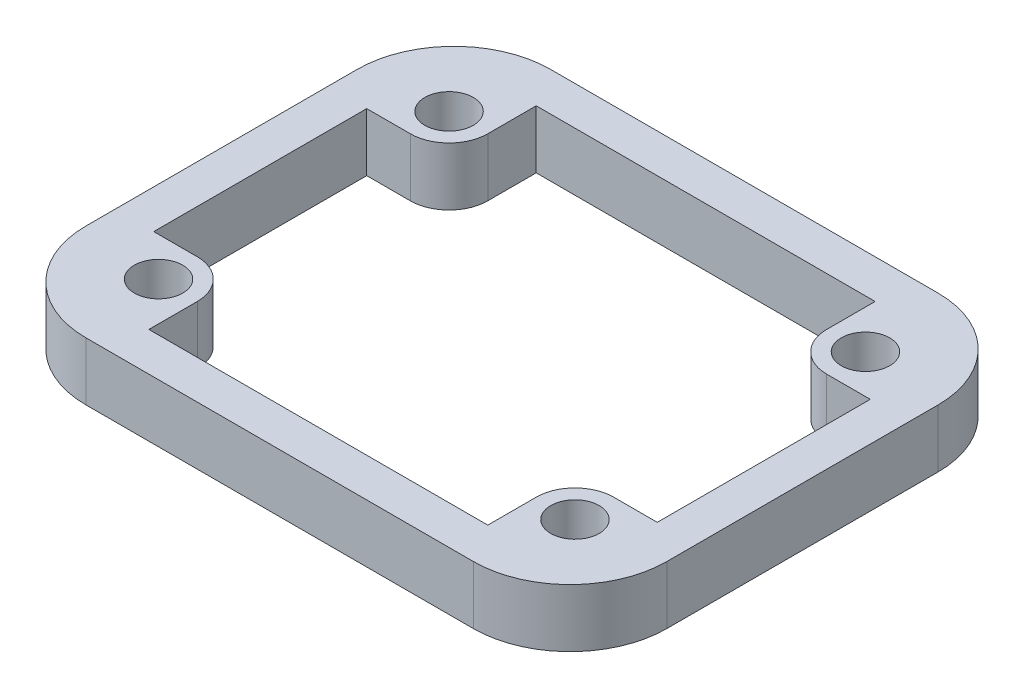
ISO-10303-21;
HEADER;
FILE_DESCRIPTION(('STEP AP214'),'2;1');
FILE_NAME('part.step','',(''),(''),'','','');
FILE_SCHEMA(('AUTOMOTIVE_DESIGN { 1 0 10303 214 1 1 1 1 }'));
ENDSEC;
DATA;
#1=APPLICATION_CONTEXT('core data for automotive mechanical design processes');
#2=APPLICATION_PROTOCOL_DEFINITION('international standard','automotive_design',2000,#1);
#3=PRODUCT_CONTEXT('',#1,'mechanical');
#4=PRODUCT('Part','Part','',(#3));
#5=PRODUCT_RELATED_PRODUCT_CATEGORY('part','',(#4));
#6=PRODUCT_DEFINITION_FORMATION('','',#4);
#7=PRODUCT_DEFINITION_CONTEXT('part definition',#1,'design');
#8=PRODUCT_DEFINITION('design','',#6,#7);
#9=PRODUCT_DEFINITION_SHAPE('','',#8);
#10=(LENGTH_UNIT() NAMED_UNIT(*) SI_UNIT(.MILLI.,.METRE.));
#11=(NAMED_UNIT(*) PLANE_ANGLE_UNIT() SI_UNIT($,.RADIAN.));
#12=(NAMED_UNIT(*) SI_UNIT($,.STERADIAN.) SOLID_ANGLE_UNIT());
#13=UNCERTAINTY_MEASURE_WITH_UNIT(LENGTH_MEASURE(1.E-05),#10,'distance_accuracy_value','');
#14=(GEOMETRIC_REPRESENTATION_CONTEXT(3) GLOBAL_UNCERTAINTY_ASSIGNED_CONTEXT((#13)) GLOBAL_UNIT_ASSIGNED_CONTEXT((#10,
#11,#12)) REPRESENTATION_CONTEXT('',''));
#15=CARTESIAN_POINT('',(0.,0.,0.));
#16=DIRECTION('',(0.,0.,1.));
#17=DIRECTION('',(1.,0.,0.));
#18=AXIS2_PLACEMENT_3D('',#15,#16,#17);
#19=CARTESIAN_POINT('',(0.,3.,0.));
#20=DIRECTION('',(0.,1.,0.));
#21=DIRECTION('',(0.,0.,1.));
#22=AXIS2_PLACEMENT_3D('',#19,#20,#21);
#23=PLANE('',#22);
#24=CARTESIAN_POINT('',(10.75,3.,-7.5));
#25=DIRECTION('',(0.,1.,0.));
#26=DIRECTION('',(0.,0.,-1.));
#27=AXIS2_PLACEMENT_3D('',#24,#25,#26);
#28=CIRCLE('',#27,1.25);
#29=CARTESIAN_POINT('',(10.75,3.,-8.75));
#30=VERTEX_POINT('',#29);
#31=EDGE_CURVE('E227',#30,#30,#28,.T.);
#32=ORIENTED_EDGE('',*,*,#31,.F.);
#33=EDGE_LOOP('',(#32));
#34=FACE_BOUND('',#33,.T.);
#35=CARTESIAN_POINT('',(10.75,3.,7.5));
#36=DIRECTION('',(0.,1.,0.));
#37=DIRECTION('',(0.,0.,1.));
#38=AXIS2_PLACEMENT_3D('',#35,#36,#37);
#39=CIRCLE('',#38,1.25);
#40=CARTESIAN_POINT('',(10.75,3.,8.75));
#41=VERTEX_POINT('',#40);
#42=EDGE_CURVE('E394',#41,#41,#39,.T.);
#43=ORIENTED_EDGE('',*,*,#42,.F.);
#44=EDGE_LOOP('',(#43));
#45=FACE_BOUND('',#44,.T.);
#46=CARTESIAN_POINT('',(-10.75,3.,7.5));
#47=DIRECTION('',(0.,1.,0.));
#48=DIRECTION('',(0.,0.,-1.));
#49=AXIS2_PLACEMENT_3D('',#46,#47,#48);
#50=CIRCLE('',#49,1.25);
#51=CARTESIAN_POINT('',(-10.75,3.,6.25));
#52=VERTEX_POINT('',#51);
#53=EDGE_CURVE('E386',#52,#52,#50,.T.);
#54=ORIENTED_EDGE('',*,*,#53,.F.);
#55=EDGE_LOOP('',(#54));
#56=FACE_BOUND('',#55,.T.);
#57=CARTESIAN_POINT('',(-10.75,3.,-7.5));
#58=DIRECTION('',(0.,1.,0.));
#59=DIRECTION('',(0.,0.,1.));
#60=AXIS2_PLACEMENT_3D('',#57,#58,#59);
#61=CIRCLE('',#60,1.25);
#62=CARTESIAN_POINT('',(-10.75,3.,-6.25));
#63=VERTEX_POINT('',#62);
#64=EDGE_CURVE('E405',#63,#63,#61,.T.);
#65=ORIENTED_EDGE('',*,*,#64,.F.);
#66=EDGE_LOOP('',(#65));
#67=FACE_BOUND('',#66,.T.);
#68=DIRECTION('',(0.,0.,1.));
#69=VECTOR('',#68,1.);
#70=CARTESIAN_POINT('',(-15.,3.,-12.));
#71=LINE('',#70,#69);
#72=CARTESIAN_POINT('',(-15.,3.,-7.));
#73=VERTEX_POINT('',#72);
#74=CARTESIAN_POINT('',(-15.,3.,7.00000000000001));
#75=VERTEX_POINT('',#74);
#76=EDGE_CURVE('E420',#73,#75,#71,.T.);
#77=ORIENTED_EDGE('',*,*,#76,.T.);
#78=CARTESIAN_POINT('',(-10.,3.,7.));
#79=DIRECTION('',(0.,1.,0.));
#80=DIRECTION('',(0.,0.,1.));
#81=AXIS2_PLACEMENT_3D('',#78,#79,#80);
#82=CIRCLE('',#81,5.);
#83=CARTESIAN_POINT('',(-10.,3.,12.));
#84=VERTEX_POINT('',#83);
#85=EDGE_CURVE('E475',#75,#84,#82,.T.);
#86=ORIENTED_EDGE('',*,*,#85,.T.);
#87=DIRECTION('',(1.,0.,0.));
#88=VECTOR('',#87,1.);
#89=CARTESIAN_POINT('',(-15.,3.,12.));
#90=LINE('',#89,#88);
#91=CARTESIAN_POINT('',(10.,3.,12.));
#92=VERTEX_POINT('',#91);
#93=EDGE_CURVE('E424',#84,#92,#90,.T.);
#94=ORIENTED_EDGE('',*,*,#93,.T.);
#95=CARTESIAN_POINT('',(10.,3.,7.));
#96=DIRECTION('',(0.,1.,0.));
#97=DIRECTION('',(0.,0.,1.));
#98=AXIS2_PLACEMENT_3D('',#95,#96,#97);
#99=CIRCLE('',#98,5.);
#100=CARTESIAN_POINT('',(15.,3.,7.));
#101=VERTEX_POINT('',#100);
#102=EDGE_CURVE('E472',#92,#101,#99,.T.);
#103=ORIENTED_EDGE('',*,*,#102,.T.);
#104=DIRECTION('',(0.,0.,-1.));
#105=VECTOR('',#104,1.);
#106=CARTESIAN_POINT('',(15.,3.,-12.));
#107=LINE('',#106,#105);
#108=CARTESIAN_POINT('',(15.,3.,-7.));
#109=VERTEX_POINT('',#108);
#110=EDGE_CURVE('E413',#101,#109,#107,.T.);
#111=ORIENTED_EDGE('',*,*,#110,.T.);
#112=CARTESIAN_POINT('',(10.,3.,-7.));
#113=DIRECTION('',(0.,1.,0.));
#114=DIRECTION('',(0.,0.,1.));
#115=AXIS2_PLACEMENT_3D('',#112,#113,#114);
#116=CIRCLE('',#115,5.);
#117=CARTESIAN_POINT('',(10.,3.,-12.));
#118=VERTEX_POINT('',#117);
#119=EDGE_CURVE('E65',#109,#118,#116,.T.);
#120=ORIENTED_EDGE('',*,*,#119,.T.);
#121=DIRECTION('',(-1.,0.,0.));
#122=VECTOR('',#121,1.);
#123=CARTESIAN_POINT('',(-15.,3.,-12.));
#124=LINE('',#123,#122);
#125=CARTESIAN_POINT('',(-10.,3.,-12.));
#126=VERTEX_POINT('',#125);
#127=EDGE_CURVE('E416',#118,#126,#124,.T.);
#128=ORIENTED_EDGE('',*,*,#127,.T.);
#129=CARTESIAN_POINT('',(-10.,3.,-7.));
#130=DIRECTION('',(0.,1.,0.));
#131=DIRECTION('',(0.,0.,1.));
#132=AXIS2_PLACEMENT_3D('',#129,#130,#131);
#133=CIRCLE('',#132,5.);
#134=EDGE_CURVE('E467',#126,#73,#133,.T.);
#135=ORIENTED_EDGE('',*,*,#134,.T.);
#136=EDGE_LOOP('',(#77,#86,#94,#103,#111,#120,#128,#135));
#137=FACE_BOUND('',#136,.T.);
#138=DIRECTION('',(-1.,0.,0.));
#139=VECTOR('',#138,1.);
#140=CARTESIAN_POINT('',(-8.75,3.,-10.));
#141=LINE('',#140,#139);
#142=CARTESIAN_POINT('',(8.75,3.,-10.));
#143=VERTEX_POINT('',#142);
#144=CARTESIAN_POINT('',(-8.75,3.,-10.));
#145=VERTEX_POINT('',#144);
#146=EDGE_CURVE('E218',#143,#145,#141,.T.);
#147=ORIENTED_EDGE('',*,*,#146,.F.);
#148=DIRECTION('',(0.,0.,-1.));
#149=VECTOR('',#148,1.);
#150=CARTESIAN_POINT('',(8.75,3.,-10.));
#151=LINE('',#150,#149);
#152=CARTESIAN_POINT('',(8.75,3.,-7.5));
#153=VERTEX_POINT('',#152);
#154=EDGE_CURVE('E207',#153,#143,#151,.T.);
#155=ORIENTED_EDGE('',*,*,#154,.F.);
#156=CARTESIAN_POINT('',(10.75,3.,-7.5));
#157=DIRECTION('',(0.,-1.,0.));
#158=DIRECTION('',(0.,0.,-1.));
#159=AXIS2_PLACEMENT_3D('',#156,#157,#158);
#160=CIRCLE('',#159,2.);
#161=CARTESIAN_POINT('',(10.75,3.,-5.5));
#162=VERTEX_POINT('',#161);
#163=EDGE_CURVE('E275',#162,#153,#160,.T.);
#164=ORIENTED_EDGE('',*,*,#163,.F.);
#165=DIRECTION('',(-1.,0.,0.));
#166=VECTOR('',#165,1.);
#167=CARTESIAN_POINT('',(10.75,3.,-5.5));
#168=LINE('',#167,#166);
#169=CARTESIAN_POINT('',(13.,3.,-5.5));
#170=VERTEX_POINT('',#169);
#171=EDGE_CURVE('E271',#170,#162,#168,.T.);
#172=ORIENTED_EDGE('',*,*,#171,.F.);
#173=DIRECTION('',(0.,0.,-1.));
#174=VECTOR('',#173,1.);
#175=CARTESIAN_POINT('',(13.,3.,-5.5));
#176=LINE('',#175,#174);
#177=CARTESIAN_POINT('',(13.,3.,5.5));
#178=VERTEX_POINT('',#177);
#179=EDGE_CURVE('E268',#178,#170,#176,.T.);
#180=ORIENTED_EDGE('',*,*,#179,.F.);
#181=DIRECTION('',(1.,0.,0.));
#182=VECTOR('',#181,1.);
#183=CARTESIAN_POINT('',(13.,3.,5.5));
#184=LINE('',#183,#182);
#185=CARTESIAN_POINT('',(10.75,3.,5.5));
#186=VERTEX_POINT('',#185);
#187=EDGE_CURVE('E265',#186,#178,#184,.T.);
#188=ORIENTED_EDGE('',*,*,#187,.F.);
#189=CARTESIAN_POINT('',(10.75,3.,7.5));
#190=DIRECTION('',(0.,-1.,0.));
#191=DIRECTION('',(0.,0.,1.));
#192=AXIS2_PLACEMENT_3D('',#189,#190,#191);
#193=CIRCLE('',#192,2.);
#194=CARTESIAN_POINT('',(8.75,3.,7.5));
#195=VERTEX_POINT('',#194);
#196=EDGE_CURVE('E262',#195,#186,#193,.T.);
#197=ORIENTED_EDGE('',*,*,#196,.F.);
#198=DIRECTION('',(0.,0.,-1.));
#199=VECTOR('',#198,1.);
#200=CARTESIAN_POINT('',(8.75,3.,7.5));
#201=LINE('',#200,#199);
#202=CARTESIAN_POINT('',(8.75,3.,10.));
#203=VERTEX_POINT('',#202);
#204=EDGE_CURVE('E259',#203,#195,#201,.T.);
#205=ORIENTED_EDGE('',*,*,#204,.F.);
#206=DIRECTION('',(1.,0.,0.));
#207=VECTOR('',#206,1.);
#208=CARTESIAN_POINT('',(8.75,3.,10.));
#209=LINE('',#208,#207);
#210=CARTESIAN_POINT('',(-8.75,3.,10.));
#211=VERTEX_POINT('',#210);
#212=EDGE_CURVE('E256',#211,#203,#209,.T.);
#213=ORIENTED_EDGE('',*,*,#212,.F.);
#214=DIRECTION('',(0.,0.,1.));
#215=VECTOR('',#214,1.);
#216=CARTESIAN_POINT('',(-8.75,3.,10.));
#217=LINE('',#216,#215);
#218=CARTESIAN_POINT('',(-8.75,3.,7.5));
#219=VERTEX_POINT('',#218);
#220=EDGE_CURVE('E253',#219,#211,#217,.T.);
#221=ORIENTED_EDGE('',*,*,#220,.F.);
#222=CARTESIAN_POINT('',(-10.75,3.,7.5));
#223=DIRECTION('',(0.,-1.,0.));
#224=DIRECTION('',(0.,0.,-1.));
#225=AXIS2_PLACEMENT_3D('',#222,#223,#224);
#226=CIRCLE('',#225,2.);
#227=CARTESIAN_POINT('',(-10.75,3.,5.5));
#228=VERTEX_POINT('',#227);
#229=EDGE_CURVE('E250',#228,#219,#226,.T.);
#230=ORIENTED_EDGE('',*,*,#229,.F.);
#231=DIRECTION('',(1.,0.,0.));
#232=VECTOR('',#231,1.);
#233=CARTESIAN_POINT('',(-13.,3.,5.5));
#234=LINE('',#233,#232);
#235=CARTESIAN_POINT('',(-13.,3.,5.5));
#236=VERTEX_POINT('',#235);
#237=EDGE_CURVE('E247',#236,#228,#234,.T.);
#238=ORIENTED_EDGE('',*,*,#237,.F.);
#239=DIRECTION('',(0.,0.,1.));
#240=VECTOR('',#239,1.);
#241=CARTESIAN_POINT('',(-13.,3.,-5.5));
#242=LINE('',#241,#240);
#243=CARTESIAN_POINT('',(-13.,3.,-5.5));
#244=VERTEX_POINT('',#243);
#245=EDGE_CURVE('E244',#244,#236,#242,.T.);
#246=ORIENTED_EDGE('',*,*,#245,.F.);
#247=DIRECTION('',(-1.,0.,0.));
#248=VECTOR('',#247,1.);
#249=CARTESIAN_POINT('',(-10.75,3.,-5.5));
#250=LINE('',#249,#248);
#251=CARTESIAN_POINT('',(-10.75,3.,-5.5));
#252=VERTEX_POINT('',#251);
#253=EDGE_CURVE('E241',#252,#244,#250,.T.);
#254=ORIENTED_EDGE('',*,*,#253,.F.);
#255=CARTESIAN_POINT('',(-10.75,3.,-7.5));
#256=DIRECTION('',(0.,-1.,0.));
#257=DIRECTION('',(0.,0.,1.));
#258=AXIS2_PLACEMENT_3D('',#255,#256,#257);
#259=CIRCLE('',#258,2.);
#260=CARTESIAN_POINT('',(-8.75,3.,-7.5));
#261=VERTEX_POINT('',#260);
#262=EDGE_CURVE('E236',#261,#252,#259,.T.);
#263=ORIENTED_EDGE('',*,*,#262,.F.);
#264=DIRECTION('',(0.,0.,1.));
#265=VECTOR('',#264,1.);
#266=CARTESIAN_POINT('',(-8.75,3.,-7.5));
#267=LINE('',#266,#265);
#268=EDGE_CURVE('E232',#145,#261,#267,.T.);
#269=ORIENTED_EDGE('',*,*,#268,.F.);
#270=EDGE_LOOP('',(#147,#155,#164,#172,#180,#188,#197,#205,#213,#221,#230,#238,#246,#254,#263,#269));
#271=FACE_BOUND('',#270,.T.);
#272=ADVANCED_FACE('F43',(#34,#45,#56,#67,#137,#271),#23,.T.);
#273=CARTESIAN_POINT('',(0.,0.,0.));
#274=DIRECTION('',(0.,1.,0.));
#275=DIRECTION('',(0.,0.,1.));
#276=AXIS2_PLACEMENT_3D('',#273,#274,#275);
#277=PLANE('',#276);
#278=DIRECTION('',(1.,0.,0.));
#279=VECTOR('',#278,1.);
#280=CARTESIAN_POINT('',(-15.,0.,12.));
#281=LINE('',#280,#279);
#282=CARTESIAN_POINT('',(-10.,0.,12.));
#283=VERTEX_POINT('',#282);
#284=CARTESIAN_POINT('',(10.,0.,12.));
#285=VERTEX_POINT('',#284);
#286=EDGE_CURVE('E417',#283,#285,#281,.T.);
#287=ORIENTED_EDGE('',*,*,#286,.F.);
#288=CARTESIAN_POINT('',(-10.,0.,7.));
#289=DIRECTION('',(0.,1.,0.));
#290=DIRECTION('',(0.,0.,1.));
#291=AXIS2_PLACEMENT_3D('',#288,#289,#290);
#292=CIRCLE('',#291,5.);
#293=CARTESIAN_POINT('',(-15.,0.,7.00000000000001));
#294=VERTEX_POINT('',#293);
#295=EDGE_CURVE('E457',#283,#294,#292,.F.);
#296=ORIENTED_EDGE('',*,*,#295,.T.);
#297=DIRECTION('',(0.,0.,1.));
#298=VECTOR('',#297,1.);
#299=CARTESIAN_POINT('',(-15.,0.,-12.));
#300=LINE('',#299,#298);
#301=CARTESIAN_POINT('',(-15.,0.,-7.));
#302=VERTEX_POINT('',#301);
#303=EDGE_CURVE('E435',#302,#294,#300,.T.);
#304=ORIENTED_EDGE('',*,*,#303,.F.);
#305=CARTESIAN_POINT('',(-10.,0.,-7.));
#306=DIRECTION('',(0.,1.,0.));
#307=DIRECTION('',(0.,0.,1.));
#308=AXIS2_PLACEMENT_3D('',#305,#306,#307);
#309=CIRCLE('',#308,5.);
#310=CARTESIAN_POINT('',(-10.,0.,-12.));
#311=VERTEX_POINT('',#310);
#312=EDGE_CURVE('E448',#302,#311,#309,.F.);
#313=ORIENTED_EDGE('',*,*,#312,.T.);
#314=DIRECTION('',(-1.,0.,0.));
#315=VECTOR('',#314,1.);
#316=CARTESIAN_POINT('',(-15.,0.,-12.));
#317=LINE('',#316,#315);
#318=CARTESIAN_POINT('',(10.,0.,-12.));
#319=VERTEX_POINT('',#318);
#320=EDGE_CURVE('E432',#319,#311,#317,.T.);
#321=ORIENTED_EDGE('',*,*,#320,.F.);
#322=CARTESIAN_POINT('',(10.,0.,-7.));
#323=DIRECTION('',(0.,1.,0.));
#324=DIRECTION('',(0.,0.,1.));
#325=AXIS2_PLACEMENT_3D('',#322,#323,#324);
#326=CIRCLE('',#325,5.);
#327=CARTESIAN_POINT('',(15.,0.,-7.));
#328=VERTEX_POINT('',#327);
#329=EDGE_CURVE('E451',#319,#328,#326,.F.);
#330=ORIENTED_EDGE('',*,*,#329,.T.);
#331=DIRECTION('',(0.,0.,-1.));
#332=VECTOR('',#331,1.);
#333=CARTESIAN_POINT('',(15.,0.,-12.));
#334=LINE('',#333,#332);
#335=CARTESIAN_POINT('',(15.,0.,7.));
#336=VERTEX_POINT('',#335);
#337=EDGE_CURVE('E409',#336,#328,#334,.T.);
#338=ORIENTED_EDGE('',*,*,#337,.F.);
#339=CARTESIAN_POINT('',(10.,0.,7.));
#340=DIRECTION('',(0.,1.,0.));
#341=DIRECTION('',(0.,0.,1.));
#342=AXIS2_PLACEMENT_3D('',#339,#340,#341);
#343=CIRCLE('',#342,5.);
#344=EDGE_CURVE('E454',#336,#285,#343,.F.);
#345=ORIENTED_EDGE('',*,*,#344,.T.);
#346=EDGE_LOOP('',(#287,#296,#304,#313,#321,#330,#338,#345));
#347=FACE_BOUND('',#346,.T.);
#348=CARTESIAN_POINT('',(-10.75,0.,-7.5));
#349=DIRECTION('',(0.,1.,0.));
#350=DIRECTION('',(0.,0.,1.));
#351=AXIS2_PLACEMENT_3D('',#348,#349,#350);
#352=CIRCLE('',#351,1.25);
#353=CARTESIAN_POINT('',(-10.75,0.,-6.25));
#354=VERTEX_POINT('',#353);
#355=EDGE_CURVE('E385',#354,#354,#352,.T.);
#356=ORIENTED_EDGE('',*,*,#355,.T.);
#357=EDGE_LOOP('',(#356));
#358=FACE_BOUND('',#357,.T.);
#359=CARTESIAN_POINT('',(-10.75,0.,7.5));
#360=DIRECTION('',(0.,1.,0.));
#361=DIRECTION('',(0.,0.,-1.));
#362=AXIS2_PLACEMENT_3D('',#359,#360,#361);
#363=CIRCLE('',#362,1.25);
#364=CARTESIAN_POINT('',(-10.75,0.,6.25));
#365=VERTEX_POINT('',#364);
#366=EDGE_CURVE('E381',#365,#365,#363,.T.);
#367=ORIENTED_EDGE('',*,*,#366,.T.);
#368=EDGE_LOOP('',(#367));
#369=FACE_BOUND('',#368,.T.);
#370=CARTESIAN_POINT('',(10.75,0.,7.5));
#371=DIRECTION('',(0.,1.,0.));
#372=DIRECTION('',(0.,0.,1.));
#373=AXIS2_PLACEMENT_3D('',#370,#371,#372);
#374=CIRCLE('',#373,1.25);
#375=CARTESIAN_POINT('',(10.75,0.,8.75));
#376=VERTEX_POINT('',#375);
#377=EDGE_CURVE('E390',#376,#376,#374,.T.);
#378=ORIENTED_EDGE('',*,*,#377,.T.);
#379=EDGE_LOOP('',(#378));
#380=FACE_BOUND('',#379,.T.);
#381=CARTESIAN_POINT('',(10.75,0.,-7.5));
#382=DIRECTION('',(0.,1.,0.));
#383=DIRECTION('',(0.,0.,-1.));
#384=AXIS2_PLACEMENT_3D('',#381,#382,#383);
#385=CIRCLE('',#384,1.25);
#386=CARTESIAN_POINT('',(10.75,0.,-8.75));
#387=VERTEX_POINT('',#386);
#388=EDGE_CURVE('E398',#387,#387,#385,.T.);
#389=ORIENTED_EDGE('',*,*,#388,.T.);
#390=EDGE_LOOP('',(#389));
#391=FACE_BOUND('',#390,.T.);
#392=DIRECTION('',(0.,0.,-1.));
#393=VECTOR('',#392,1.);
#394=CARTESIAN_POINT('',(8.75,0.,-10.));
#395=LINE('',#394,#393);
#396=CARTESIAN_POINT('',(8.75,0.,-7.5));
#397=VERTEX_POINT('',#396);
#398=CARTESIAN_POINT('',(8.75,0.,-10.));
#399=VERTEX_POINT('',#398);
#400=EDGE_CURVE('E278',#397,#399,#395,.T.);
#401=ORIENTED_EDGE('',*,*,#400,.T.);
#402=DIRECTION('',(-1.,0.,0.));
#403=VECTOR('',#402,1.);
#404=CARTESIAN_POINT('',(-8.75,0.,-10.));
#405=LINE('',#404,#403);
#406=CARTESIAN_POINT('',(-8.75,0.,-10.));
#407=VERTEX_POINT('',#406);
#408=EDGE_CURVE('E225',#399,#407,#405,.T.);
#409=ORIENTED_EDGE('',*,*,#408,.T.);
#410=DIRECTION('',(0.,0.,1.));
#411=VECTOR('',#410,1.);
#412=CARTESIAN_POINT('',(-8.75,0.,-7.5));
#413=LINE('',#412,#411);
#414=CARTESIAN_POINT('',(-8.75,0.,-7.5));
#415=VERTEX_POINT('',#414);
#416=EDGE_CURVE('E283',#407,#415,#413,.T.);
#417=ORIENTED_EDGE('',*,*,#416,.T.);
#418=CARTESIAN_POINT('',(-10.75,0.,-7.5));
#419=DIRECTION('',(0.,-1.,0.));
#420=DIRECTION('',(0.,0.,1.));
#421=AXIS2_PLACEMENT_3D('',#418,#419,#420);
#422=CIRCLE('',#421,2.);
#423=CARTESIAN_POINT('',(-10.75,0.,-5.5));
#424=VERTEX_POINT('',#423);
#425=EDGE_CURVE('E287',#415,#424,#422,.T.);
#426=ORIENTED_EDGE('',*,*,#425,.T.);
#427=DIRECTION('',(-1.,0.,0.));
#428=VECTOR('',#427,1.);
#429=CARTESIAN_POINT('',(-10.75,0.,-5.5));
#430=LINE('',#429,#428);
#431=CARTESIAN_POINT('',(-13.,0.,-5.5));
#432=VERTEX_POINT('',#431);
#433=EDGE_CURVE('E291',#424,#432,#430,.T.);
#434=ORIENTED_EDGE('',*,*,#433,.T.);
#435=DIRECTION('',(0.,0.,1.));
#436=VECTOR('',#435,1.);
#437=CARTESIAN_POINT('',(-13.,0.,-5.5));
#438=LINE('',#437,#436);
#439=CARTESIAN_POINT('',(-13.,0.,5.5));
#440=VERTEX_POINT('',#439);
#441=EDGE_CURVE('E295',#432,#440,#438,.T.);
#442=ORIENTED_EDGE('',*,*,#441,.T.);
#443=DIRECTION('',(1.,0.,0.));
#444=VECTOR('',#443,1.);
#445=CARTESIAN_POINT('',(-13.,0.,5.5));
#446=LINE('',#445,#444);
#447=CARTESIAN_POINT('',(-10.75,0.,5.5));
#448=VERTEX_POINT('',#447);
#449=EDGE_CURVE('E299',#440,#448,#446,.T.);
#450=ORIENTED_EDGE('',*,*,#449,.T.);
#451=CARTESIAN_POINT('',(-10.75,0.,7.5));
#452=DIRECTION('',(0.,-1.,0.));
#453=DIRECTION('',(0.,0.,-1.));
#454=AXIS2_PLACEMENT_3D('',#451,#452,#453);
#455=CIRCLE('',#454,2.);
#456=CARTESIAN_POINT('',(-8.75,0.,7.5));
#457=VERTEX_POINT('',#456);
#458=EDGE_CURVE('E303',#448,#457,#455,.T.);
#459=ORIENTED_EDGE('',*,*,#458,.T.);
#460=DIRECTION('',(0.,0.,1.));
#461=VECTOR('',#460,1.);
#462=CARTESIAN_POINT('',(-8.75,0.,10.));
#463=LINE('',#462,#461);
#464=CARTESIAN_POINT('',(-8.75,0.,10.));
#465=VERTEX_POINT('',#464);
#466=EDGE_CURVE('E307',#457,#465,#463,.T.);
#467=ORIENTED_EDGE('',*,*,#466,.T.);
#468=DIRECTION('',(1.,0.,0.));
#469=VECTOR('',#468,1.);
#470=CARTESIAN_POINT('',(8.75,0.,10.));
#471=LINE('',#470,#469);
#472=CARTESIAN_POINT('',(8.75,0.,10.));
#473=VERTEX_POINT('',#472);
#474=EDGE_CURVE('E311',#465,#473,#471,.T.);
#475=ORIENTED_EDGE('',*,*,#474,.T.);
#476=DIRECTION('',(0.,0.,-1.));
#477=VECTOR('',#476,1.);
#478=CARTESIAN_POINT('',(8.75,0.,7.5));
#479=LINE('',#478,#477);
#480=CARTESIAN_POINT('',(8.75,0.,7.5));
#481=VERTEX_POINT('',#480);
#482=EDGE_CURVE('E315',#473,#481,#479,.T.);
#483=ORIENTED_EDGE('',*,*,#482,.T.);
#484=CARTESIAN_POINT('',(10.75,0.,7.5));
#485=DIRECTION('',(0.,-1.,0.));
#486=DIRECTION('',(0.,0.,1.));
#487=AXIS2_PLACEMENT_3D('',#484,#485,#486);
#488=CIRCLE('',#487,2.);
#489=CARTESIAN_POINT('',(10.75,0.,5.5));
#490=VERTEX_POINT('',#489);
#491=EDGE_CURVE('E319',#481,#490,#488,.T.);
#492=ORIENTED_EDGE('',*,*,#491,.T.);
#493=DIRECTION('',(1.,0.,0.));
#494=VECTOR('',#493,1.);
#495=CARTESIAN_POINT('',(13.,0.,5.5));
#496=LINE('',#495,#494);
#497=CARTESIAN_POINT('',(13.,0.,5.5));
#498=VERTEX_POINT('',#497);
#499=EDGE_CURVE('E323',#490,#498,#496,.T.);
#500=ORIENTED_EDGE('',*,*,#499,.T.);
#501=DIRECTION('',(0.,0.,-1.));
#502=VECTOR('',#501,1.);
#503=CARTESIAN_POINT('',(13.,0.,-5.5));
#504=LINE('',#503,#502);
#505=CARTESIAN_POINT('',(13.,0.,-5.5));
#506=VERTEX_POINT('',#505);
#507=EDGE_CURVE('E327',#498,#506,#504,.T.);
#508=ORIENTED_EDGE('',*,*,#507,.T.);
#509=DIRECTION('',(-1.,0.,0.));
#510=VECTOR('',#509,1.);
#511=CARTESIAN_POINT('',(10.75,0.,-5.5));
#512=LINE('',#511,#510);
#513=CARTESIAN_POINT('',(10.75,0.,-5.5));
#514=VERTEX_POINT('',#513);
#515=EDGE_CURVE('E331',#506,#514,#512,.T.);
#516=ORIENTED_EDGE('',*,*,#515,.T.);
#517=CARTESIAN_POINT('',(10.75,0.,-7.5));
#518=DIRECTION('',(0.,-1.,0.));
#519=DIRECTION('',(0.,0.,-1.));
#520=AXIS2_PLACEMENT_3D('',#517,#518,#519);
#521=CIRCLE('',#520,2.);
#522=EDGE_CURVE('E219',#514,#397,#521,.T.);
#523=ORIENTED_EDGE('',*,*,#522,.T.);
#524=EDGE_LOOP('',(#401,#409,#417,#426,#434,#442,#450,#459,#467,#475,#483,#492,#500,#508,#516,#523));
#525=FACE_BOUND('',#524,.T.);
#526=ADVANCED_FACE('F495',(#347,#358,#369,#380,#391,#525),#277,.F.);
#527=CARTESIAN_POINT('',(15.,3.,-12.));
#528=DIRECTION('',(-1.,0.,0.));
#529=DIRECTION('',(0.,0.,1.));
#530=AXIS2_PLACEMENT_3D('',#527,#528,#529);
#531=PLANE('',#530);
#532=ORIENTED_EDGE('',*,*,#110,.F.);
#533=DIRECTION('',(0.,-1.,0.));
#534=VECTOR('',#533,1.);
#535=CARTESIAN_POINT('',(15.,3.,7.));
#536=LINE('',#535,#534);
#537=EDGE_CURVE('E481',#101,#336,#536,.T.);
#538=ORIENTED_EDGE('',*,*,#537,.T.);
#539=ORIENTED_EDGE('',*,*,#337,.T.);
#540=DIRECTION('',(0.,-1.,0.));
#541=VECTOR('',#540,1.);
#542=CARTESIAN_POINT('',(15.,3.,-7.));
#543=LINE('',#542,#541);
#544=EDGE_CURVE('E478',#328,#109,#543,.F.);
#545=ORIENTED_EDGE('',*,*,#544,.T.);
#546=EDGE_LOOP('',(#532,#538,#539,#545));
#547=FACE_BOUND('',#546,.T.);
#548=ADVANCED_FACE('F489',(#547),#531,.F.);
#549=CARTESIAN_POINT('',(-15.,3.,-12.));
#550=DIRECTION('',(0.,0.,1.));
#551=DIRECTION('',(1.,0.,0.));
#552=AXIS2_PLACEMENT_3D('',#549,#550,#551);
#553=PLANE('',#552);
#554=ORIENTED_EDGE('',*,*,#127,.F.);
#555=DIRECTION('',(0.,-1.,0.));
#556=VECTOR('',#555,1.);
#557=CARTESIAN_POINT('',(10.,3.,-12.));
#558=LINE('',#557,#556);
#559=EDGE_CURVE('E11',#118,#319,#558,.T.);
#560=ORIENTED_EDGE('',*,*,#559,.T.);
#561=ORIENTED_EDGE('',*,*,#320,.T.);
#562=DIRECTION('',(0.,-1.,0.));
#563=VECTOR('',#562,1.);
#564=CARTESIAN_POINT('',(-10.,3.,-12.));
#565=LINE('',#564,#563);
#566=EDGE_CURVE('E52',#311,#126,#565,.F.);
#567=ORIENTED_EDGE('',*,*,#566,.T.);
#568=EDGE_LOOP('',(#554,#560,#561,#567));
#569=FACE_BOUND('',#568,.T.);
#570=ADVANCED_FACE('F501',(#569),#553,.F.);
#571=CARTESIAN_POINT('',(-15.,3.,-12.));
#572=DIRECTION('',(1.,0.,0.));
#573=DIRECTION('',(0.,0.,-1.));
#574=AXIS2_PLACEMENT_3D('',#571,#572,#573);
#575=PLANE('',#574);
#576=ORIENTED_EDGE('',*,*,#303,.T.);
#577=DIRECTION('',(0.,-1.,0.));
#578=VECTOR('',#577,1.);
#579=CARTESIAN_POINT('',(-15.,3.,7.00000000000001));
#580=LINE('',#579,#578);
#581=EDGE_CURVE('E464',#294,#75,#580,.F.);
#582=ORIENTED_EDGE('',*,*,#581,.T.);
#583=ORIENTED_EDGE('',*,*,#76,.F.);
#584=DIRECTION('',(0.,-1.,0.));
#585=VECTOR('',#584,1.);
#586=CARTESIAN_POINT('',(-15.,3.,-7.));
#587=LINE('',#586,#585);
#588=EDGE_CURVE('E460',#73,#302,#587,.T.);
#589=ORIENTED_EDGE('',*,*,#588,.T.);
#590=EDGE_LOOP('',(#576,#582,#583,#589));
#591=FACE_BOUND('',#590,.T.);
#592=ADVANCED_FACE('F508',(#591),#575,.F.);
#593=CARTESIAN_POINT('',(-15.,3.,12.));
#594=DIRECTION('',(0.,0.,-1.));
#595=DIRECTION('',(-1.,0.,0.));
#596=AXIS2_PLACEMENT_3D('',#593,#594,#595);
#597=PLANE('',#596);
#598=ORIENTED_EDGE('',*,*,#93,.F.);
#599=DIRECTION('',(0.,-1.,0.));
#600=VECTOR('',#599,1.);
#601=CARTESIAN_POINT('',(-10.,3.,12.));
#602=LINE('',#601,#600);
#603=EDGE_CURVE('E444',#84,#283,#602,.T.);
#604=ORIENTED_EDGE('',*,*,#603,.T.);
#605=ORIENTED_EDGE('',*,*,#286,.T.);
#606=DIRECTION('',(0.,-1.,0.));
#607=VECTOR('',#606,1.);
#608=CARTESIAN_POINT('',(10.,3.,12.));
#609=LINE('',#608,#607);
#610=EDGE_CURVE('E428',#285,#92,#609,.F.);
#611=ORIENTED_EDGE('',*,*,#610,.T.);
#612=EDGE_LOOP('',(#598,#604,#605,#611));
#613=FACE_BOUND('',#612,.T.);
#614=ADVANCED_FACE('F516',(#613),#597,.F.);
#615=CARTESIAN_POINT('',(-10.75,3.,-7.5));
#616=DIRECTION('',(0.,-1.,0.));
#617=DIRECTION('',(0.,0.,-1.));
#618=AXIS2_PLACEMENT_3D('',#615,#616,#617);
#619=CYLINDRICAL_SURFACE('',#618,1.25);
#620=ORIENTED_EDGE('',*,*,#64,.T.);
#621=EDGE_LOOP('',(#620));
#622=FACE_BOUND('',#621,.T.);
#623=ORIENTED_EDGE('',*,*,#355,.F.);
#624=EDGE_LOOP('',(#623));
#625=FACE_BOUND('',#624,.T.);
#626=ADVANCED_FACE('F537',(#622,#625),#619,.F.);
#627=CARTESIAN_POINT('',(-10.75,3.,7.5));
#628=DIRECTION('',(0.,-1.,0.));
#629=DIRECTION('',(0.,0.,-1.));
#630=AXIS2_PLACEMENT_3D('',#627,#628,#629);
#631=CYLINDRICAL_SURFACE('',#630,1.25);
#632=ORIENTED_EDGE('',*,*,#53,.T.);
#633=EDGE_LOOP('',(#632));
#634=FACE_BOUND('',#633,.T.);
#635=ORIENTED_EDGE('',*,*,#366,.F.);
#636=EDGE_LOOP('',(#635));
#637=FACE_BOUND('',#636,.T.);
#638=ADVANCED_FACE('F570',(#634,#637),#631,.F.);
#639=CARTESIAN_POINT('',(10.75,3.,7.5));
#640=DIRECTION('',(0.,-1.,0.));
#641=DIRECTION('',(0.,0.,-1.));
#642=AXIS2_PLACEMENT_3D('',#639,#640,#641);
#643=CYLINDRICAL_SURFACE('',#642,1.25);
#644=ORIENTED_EDGE('',*,*,#42,.T.);
#645=EDGE_LOOP('',(#644));
#646=FACE_BOUND('',#645,.T.);
#647=ORIENTED_EDGE('',*,*,#377,.F.);
#648=EDGE_LOOP('',(#647));
#649=FACE_BOUND('',#648,.T.);
#650=ADVANCED_FACE('F577',(#646,#649),#643,.F.);
#651=CARTESIAN_POINT('',(10.75,3.,-7.5));
#652=DIRECTION('',(0.,-1.,0.));
#653=DIRECTION('',(0.,0.,-1.));
#654=AXIS2_PLACEMENT_3D('',#651,#652,#653);
#655=CYLINDRICAL_SURFACE('',#654,1.25);
#656=ORIENTED_EDGE('',*,*,#31,.T.);
#657=EDGE_LOOP('',(#656));
#658=FACE_BOUND('',#657,.T.);
#659=ORIENTED_EDGE('',*,*,#388,.F.);
#660=EDGE_LOOP('',(#659));
#661=FACE_BOUND('',#660,.T.);
#662=ADVANCED_FACE('F585',(#658,#661),#655,.F.);
#663=CARTESIAN_POINT('',(8.75,3.,-10.));
#664=DIRECTION('',(-1.,0.,0.));
#665=DIRECTION('',(0.,0.,1.));
#666=AXIS2_PLACEMENT_3D('',#663,#664,#665);
#667=PLANE('',#666);
#668=ORIENTED_EDGE('',*,*,#400,.F.);
#669=DIRECTION('',(0.,-1.,0.));
#670=VECTOR('',#669,1.);
#671=CARTESIAN_POINT('',(8.75,3.,-7.5));
#672=LINE('',#671,#670);
#673=EDGE_CURVE('E213',#153,#397,#672,.T.);
#674=ORIENTED_EDGE('',*,*,#673,.F.);
#675=ORIENTED_EDGE('',*,*,#154,.T.);
#676=DIRECTION('',(0.,-1.,0.));
#677=VECTOR('',#676,1.);
#678=CARTESIAN_POINT('',(8.75,3.,-10.));
#679=LINE('',#678,#677);
#680=EDGE_CURVE('E210',#143,#399,#679,.T.);
#681=ORIENTED_EDGE('',*,*,#680,.T.);
#682=EDGE_LOOP('',(#668,#674,#675,#681));
#683=FACE_BOUND('',#682,.T.);
#684=ADVANCED_FACE('F209',(#683),#667,.T.);
#685=CARTESIAN_POINT('',(-8.75,3.,-10.));
#686=DIRECTION('',(0.,0.,1.));
#687=DIRECTION('',(1.,0.,0.));
#688=AXIS2_PLACEMENT_3D('',#685,#686,#687);
#689=PLANE('',#688);
#690=ORIENTED_EDGE('',*,*,#408,.F.);
#691=ORIENTED_EDGE('',*,*,#680,.F.);
#692=ORIENTED_EDGE('',*,*,#146,.T.);
#693=DIRECTION('',(0.,-1.,0.));
#694=VECTOR('',#693,1.);
#695=CARTESIAN_POINT('',(-8.75,3.,-10.));
#696=LINE('',#695,#694);
#697=EDGE_CURVE('E228',#145,#407,#696,.T.);
#698=ORIENTED_EDGE('',*,*,#697,.T.);
#699=EDGE_LOOP('',(#690,#691,#692,#698));
#700=FACE_BOUND('',#699,.T.);
#701=ADVANCED_FACE('F222',(#700),#689,.T.);
#702=CARTESIAN_POINT('',(-8.75,3.,-7.5));
#703=DIRECTION('',(1.,0.,0.));
#704=DIRECTION('',(0.,0.,-1.));
#705=AXIS2_PLACEMENT_3D('',#702,#703,#704);
#706=PLANE('',#705);
#707=ORIENTED_EDGE('',*,*,#416,.F.);
#708=ORIENTED_EDGE('',*,*,#697,.F.);
#709=ORIENTED_EDGE('',*,*,#268,.T.);
#710=DIRECTION('',(0.,-1.,0.));
#711=VECTOR('',#710,1.);
#712=CARTESIAN_POINT('',(-8.75,3.,-7.5));
#713=LINE('',#712,#711);
#714=EDGE_CURVE('E376',#261,#415,#713,.T.);
#715=ORIENTED_EDGE('',*,*,#714,.T.);
#716=EDGE_LOOP('',(#707,#708,#709,#715));
#717=FACE_BOUND('',#716,.T.);
#718=ADVANCED_FACE('F605',(#717),#706,.T.);
#719=CARTESIAN_POINT('',(-10.75,3.,-7.5));
#720=DIRECTION('',(0.,-1.,0.));
#721=DIRECTION('',(0.,0.,-1.));
#722=AXIS2_PLACEMENT_3D('',#719,#720,#721);
#723=CYLINDRICAL_SURFACE('',#722,2.);
#724=ORIENTED_EDGE('',*,*,#425,.F.);
#725=ORIENTED_EDGE('',*,*,#714,.F.);
#726=ORIENTED_EDGE('',*,*,#262,.T.);
#727=DIRECTION('',(0.,-1.,0.));
#728=VECTOR('',#727,1.);
#729=CARTESIAN_POINT('',(-10.75,3.,-5.5));
#730=LINE('',#729,#728);
#731=EDGE_CURVE('E373',#252,#424,#730,.T.);
#732=ORIENTED_EDGE('',*,*,#731,.T.);
#733=EDGE_LOOP('',(#724,#725,#726,#732));
#734=FACE_BOUND('',#733,.T.);
#735=ADVANCED_FACE('F612',(#734),#723,.T.);
#736=CARTESIAN_POINT('',(-10.75,3.,-5.5));
#737=DIRECTION('',(0.,0.,1.));
#738=DIRECTION('',(1.,0.,0.));
#739=AXIS2_PLACEMENT_3D('',#736,#737,#738);
#740=PLANE('',#739);
#741=ORIENTED_EDGE('',*,*,#433,.F.);
#742=ORIENTED_EDGE('',*,*,#731,.F.);
#743=ORIENTED_EDGE('',*,*,#253,.T.);
#744=DIRECTION('',(0.,-1.,0.));
#745=VECTOR('',#744,1.);
#746=CARTESIAN_POINT('',(-13.,3.,-5.5));
#747=LINE('',#746,#745);
#748=EDGE_CURVE('E370',#244,#432,#747,.T.);
#749=ORIENTED_EDGE('',*,*,#748,.T.);
#750=EDGE_LOOP('',(#741,#742,#743,#749));
#751=FACE_BOUND('',#750,.T.);
#752=ADVANCED_FACE('F620',(#751),#740,.T.);
#753=CARTESIAN_POINT('',(-13.,3.,-5.5));
#754=DIRECTION('',(1.,0.,0.));
#755=DIRECTION('',(0.,0.,-1.));
#756=AXIS2_PLACEMENT_3D('',#753,#754,#755);
#757=PLANE('',#756);
#758=ORIENTED_EDGE('',*,*,#441,.F.);
#759=ORIENTED_EDGE('',*,*,#748,.F.);
#760=ORIENTED_EDGE('',*,*,#245,.T.);
#761=DIRECTION('',(0.,-1.,0.));
#762=VECTOR('',#761,1.);
#763=CARTESIAN_POINT('',(-13.,3.,5.5));
#764=LINE('',#763,#762);
#765=EDGE_CURVE('E367',#236,#440,#764,.T.);
#766=ORIENTED_EDGE('',*,*,#765,.T.);
#767=EDGE_LOOP('',(#758,#759,#760,#766));
#768=FACE_BOUND('',#767,.T.);
#769=ADVANCED_FACE('F628',(#768),#757,.T.);
#770=CARTESIAN_POINT('',(-13.,3.,5.5));
#771=DIRECTION('',(0.,0.,-1.));
#772=DIRECTION('',(-1.,0.,0.));
#773=AXIS2_PLACEMENT_3D('',#770,#771,#772);
#774=PLANE('',#773);
#775=ORIENTED_EDGE('',*,*,#449,.F.);
#776=ORIENTED_EDGE('',*,*,#765,.F.);
#777=ORIENTED_EDGE('',*,*,#237,.T.);
#778=DIRECTION('',(0.,-1.,0.));
#779=VECTOR('',#778,1.);
#780=CARTESIAN_POINT('',(-10.75,3.,5.5));
#781=LINE('',#780,#779);
#782=EDGE_CURVE('E364',#228,#448,#781,.T.);
#783=ORIENTED_EDGE('',*,*,#782,.T.);
#784=EDGE_LOOP('',(#775,#776,#777,#783));
#785=FACE_BOUND('',#784,.T.);
#786=ADVANCED_FACE('F636',(#785),#774,.T.);
#787=CARTESIAN_POINT('',(-10.75,3.,7.5));
#788=DIRECTION('',(0.,-1.,0.));
#789=DIRECTION('',(0.,0.,-1.));
#790=AXIS2_PLACEMENT_3D('',#787,#788,#789);
#791=CYLINDRICAL_SURFACE('',#790,2.);
#792=ORIENTED_EDGE('',*,*,#458,.F.);
#793=ORIENTED_EDGE('',*,*,#782,.F.);
#794=ORIENTED_EDGE('',*,*,#229,.T.);
#795=DIRECTION('',(0.,-1.,0.));
#796=VECTOR('',#795,1.);
#797=CARTESIAN_POINT('',(-8.75,3.,7.5));
#798=LINE('',#797,#796);
#799=EDGE_CURVE('E361',#219,#457,#798,.T.);
#800=ORIENTED_EDGE('',*,*,#799,.T.);
#801=EDGE_LOOP('',(#792,#793,#794,#800));
#802=FACE_BOUND('',#801,.T.);
#803=ADVANCED_FACE('F644',(#802),#791,.T.);
#804=CARTESIAN_POINT('',(-8.75,3.,10.));
#805=DIRECTION('',(1.,0.,0.));
#806=DIRECTION('',(0.,0.,-1.));
#807=AXIS2_PLACEMENT_3D('',#804,#805,#806);
#808=PLANE('',#807);
#809=ORIENTED_EDGE('',*,*,#466,.F.);
#810=ORIENTED_EDGE('',*,*,#799,.F.);
#811=ORIENTED_EDGE('',*,*,#220,.T.);
#812=DIRECTION('',(0.,-1.,0.));
#813=VECTOR('',#812,1.);
#814=CARTESIAN_POINT('',(-8.75,3.,10.));
#815=LINE('',#814,#813);
#816=EDGE_CURVE('E358',#211,#465,#815,.T.);
#817=ORIENTED_EDGE('',*,*,#816,.T.);
#818=EDGE_LOOP('',(#809,#810,#811,#817));
#819=FACE_BOUND('',#818,.T.);
#820=ADVANCED_FACE('F652',(#819),#808,.T.);
#821=CARTESIAN_POINT('',(8.75,3.,10.));
#822=DIRECTION('',(0.,0.,-1.));
#823=DIRECTION('',(-1.,0.,0.));
#824=AXIS2_PLACEMENT_3D('',#821,#822,#823);
#825=PLANE('',#824);
#826=ORIENTED_EDGE('',*,*,#474,.F.);
#827=ORIENTED_EDGE('',*,*,#816,.F.);
#828=ORIENTED_EDGE('',*,*,#212,.T.);
#829=DIRECTION('',(0.,-1.,0.));
#830=VECTOR('',#829,1.);
#831=CARTESIAN_POINT('',(8.75,3.,10.));
#832=LINE('',#831,#830);
#833=EDGE_CURVE('E355',#203,#473,#832,.T.);
#834=ORIENTED_EDGE('',*,*,#833,.T.);
#835=EDGE_LOOP('',(#826,#827,#828,#834));
#836=FACE_BOUND('',#835,.T.);
#837=ADVANCED_FACE('F660',(#836),#825,.T.);
#838=CARTESIAN_POINT('',(8.75,3.,7.5));
#839=DIRECTION('',(-1.,0.,0.));
#840=DIRECTION('',(0.,0.,1.));
#841=AXIS2_PLACEMENT_3D('',#838,#839,#840);
#842=PLANE('',#841);
#843=ORIENTED_EDGE('',*,*,#482,.F.);
#844=ORIENTED_EDGE('',*,*,#833,.F.);
#845=ORIENTED_EDGE('',*,*,#204,.T.);
#846=DIRECTION('',(0.,-1.,0.));
#847=VECTOR('',#846,1.);
#848=CARTESIAN_POINT('',(8.75,3.,7.5));
#849=LINE('',#848,#847);
#850=EDGE_CURVE('E352',#195,#481,#849,.T.);
#851=ORIENTED_EDGE('',*,*,#850,.T.);
#852=EDGE_LOOP('',(#843,#844,#845,#851));
#853=FACE_BOUND('',#852,.T.);
#854=ADVANCED_FACE('F668',(#853),#842,.T.);
#855=CARTESIAN_POINT('',(10.75,3.,7.5));
#856=DIRECTION('',(0.,-1.,0.));
#857=DIRECTION('',(0.,0.,-1.));
#858=AXIS2_PLACEMENT_3D('',#855,#856,#857);
#859=CYLINDRICAL_SURFACE('',#858,2.);
#860=ORIENTED_EDGE('',*,*,#491,.F.);
#861=ORIENTED_EDGE('',*,*,#850,.F.);
#862=ORIENTED_EDGE('',*,*,#196,.T.);
#863=DIRECTION('',(0.,-1.,0.));
#864=VECTOR('',#863,1.);
#865=CARTESIAN_POINT('',(10.75,3.,5.5));
#866=LINE('',#865,#864);
#867=EDGE_CURVE('E349',#186,#490,#866,.T.);
#868=ORIENTED_EDGE('',*,*,#867,.T.);
#869=EDGE_LOOP('',(#860,#861,#862,#868));
#870=FACE_BOUND('',#869,.T.);
#871=ADVANCED_FACE('F676',(#870),#859,.T.);
#872=CARTESIAN_POINT('',(13.,3.,5.5));
#873=DIRECTION('',(0.,0.,-1.));
#874=DIRECTION('',(-1.,0.,0.));
#875=AXIS2_PLACEMENT_3D('',#872,#873,#874);
#876=PLANE('',#875);
#877=ORIENTED_EDGE('',*,*,#499,.F.);
#878=ORIENTED_EDGE('',*,*,#867,.F.);
#879=ORIENTED_EDGE('',*,*,#187,.T.);
#880=DIRECTION('',(0.,-1.,0.));
#881=VECTOR('',#880,1.);
#882=CARTESIAN_POINT('',(13.,3.,5.5));
#883=LINE('',#882,#881);
#884=EDGE_CURVE('E346',#178,#498,#883,.T.);
#885=ORIENTED_EDGE('',*,*,#884,.T.);
#886=EDGE_LOOP('',(#877,#878,#879,#885));
#887=FACE_BOUND('',#886,.T.);
#888=ADVANCED_FACE('F684',(#887),#876,.T.);
#889=CARTESIAN_POINT('',(13.,3.,-5.5));
#890=DIRECTION('',(-1.,0.,0.));
#891=DIRECTION('',(0.,0.,1.));
#892=AXIS2_PLACEMENT_3D('',#889,#890,#891);
#893=PLANE('',#892);
#894=ORIENTED_EDGE('',*,*,#507,.F.);
#895=ORIENTED_EDGE('',*,*,#884,.F.);
#896=ORIENTED_EDGE('',*,*,#179,.T.);
#897=DIRECTION('',(0.,-1.,0.));
#898=VECTOR('',#897,1.);
#899=CARTESIAN_POINT('',(13.,3.,-5.5));
#900=LINE('',#899,#898);
#901=EDGE_CURVE('E343',#170,#506,#900,.T.);
#902=ORIENTED_EDGE('',*,*,#901,.T.);
#903=EDGE_LOOP('',(#894,#895,#896,#902));
#904=FACE_BOUND('',#903,.T.);
#905=ADVANCED_FACE('F692',(#904),#893,.T.);
#906=CARTESIAN_POINT('',(10.75,3.,-5.5));
#907=DIRECTION('',(0.,0.,1.));
#908=DIRECTION('',(1.,0.,0.));
#909=AXIS2_PLACEMENT_3D('',#906,#907,#908);
#910=PLANE('',#909);
#911=ORIENTED_EDGE('',*,*,#515,.F.);
#912=ORIENTED_EDGE('',*,*,#901,.F.);
#913=ORIENTED_EDGE('',*,*,#171,.T.);
#914=DIRECTION('',(0.,-1.,0.));
#915=VECTOR('',#914,1.);
#916=CARTESIAN_POINT('',(10.75,3.,-5.5));
#917=LINE('',#916,#915);
#918=EDGE_CURVE('E340',#162,#514,#917,.T.);
#919=ORIENTED_EDGE('',*,*,#918,.T.);
#920=EDGE_LOOP('',(#911,#912,#913,#919));
#921=FACE_BOUND('',#920,.T.);
#922=ADVANCED_FACE('F700',(#921),#910,.T.);
#923=CARTESIAN_POINT('',(10.75,3.,-7.5));
#924=DIRECTION('',(0.,-1.,0.));
#925=DIRECTION('',(0.,0.,-1.));
#926=AXIS2_PLACEMENT_3D('',#923,#924,#925);
#927=CYLINDRICAL_SURFACE('',#926,2.);
#928=ORIENTED_EDGE('',*,*,#522,.F.);
#929=ORIENTED_EDGE('',*,*,#918,.F.);
#930=ORIENTED_EDGE('',*,*,#163,.T.);
#931=ORIENTED_EDGE('',*,*,#673,.T.);
#932=EDGE_LOOP('',(#928,#929,#930,#931));
#933=FACE_BOUND('',#932,.T.);
#934=ADVANCED_FACE('F525',(#933),#927,.T.);
#935=CARTESIAN_POINT('',(-10.,3.,7.));
#936=DIRECTION('',(0.,-1.,0.));
#937=DIRECTION('',(0.,0.,-1.));
#938=AXIS2_PLACEMENT_3D('',#935,#936,#937);
#939=CYLINDRICAL_SURFACE('',#938,5.);
#940=ORIENTED_EDGE('',*,*,#85,.F.);
#941=ORIENTED_EDGE('',*,*,#581,.F.);
#942=ORIENTED_EDGE('',*,*,#295,.F.);
#943=ORIENTED_EDGE('',*,*,#603,.F.);
#944=EDGE_LOOP('',(#940,#941,#942,#943));
#945=FACE_BOUND('',#944,.T.);
#946=ADVANCED_FACE('F513',(#945),#939,.T.);
#947=CARTESIAN_POINT('',(10.,3.,7.));
#948=DIRECTION('',(0.,-1.,0.));
#949=DIRECTION('',(0.,0.,-1.));
#950=AXIS2_PLACEMENT_3D('',#947,#948,#949);
#951=CYLINDRICAL_SURFACE('',#950,5.);
#952=ORIENTED_EDGE('',*,*,#102,.F.);
#953=ORIENTED_EDGE('',*,*,#610,.F.);
#954=ORIENTED_EDGE('',*,*,#344,.F.);
#955=ORIENTED_EDGE('',*,*,#537,.F.);
#956=EDGE_LOOP('',(#952,#953,#954,#955));
#957=FACE_BOUND('',#956,.T.);
#958=ADVANCED_FACE('F518',(#957),#951,.T.);
#959=CARTESIAN_POINT('',(10.,3.,-7.));
#960=DIRECTION('',(0.,-1.,0.));
#961=DIRECTION('',(0.,0.,-1.));
#962=AXIS2_PLACEMENT_3D('',#959,#960,#961);
#963=CYLINDRICAL_SURFACE('',#962,5.);
#964=ORIENTED_EDGE('',*,*,#119,.F.);
#965=ORIENTED_EDGE('',*,*,#544,.F.);
#966=ORIENTED_EDGE('',*,*,#329,.F.);
#967=ORIENTED_EDGE('',*,*,#559,.F.);
#968=EDGE_LOOP('',(#964,#965,#966,#967));
#969=FACE_BOUND('',#968,.T.);
#970=ADVANCED_FACE('F500',(#969),#963,.T.);
#971=CARTESIAN_POINT('',(-10.,3.,-7.));
#972=DIRECTION('',(0.,-1.,0.));
#973=DIRECTION('',(0.,0.,-1.));
#974=AXIS2_PLACEMENT_3D('',#971,#972,#973);
#975=CYLINDRICAL_SURFACE('',#974,5.);
#976=ORIENTED_EDGE('',*,*,#134,.F.);
#977=ORIENTED_EDGE('',*,*,#566,.F.);
#978=ORIENTED_EDGE('',*,*,#312,.F.);
#979=ORIENTED_EDGE('',*,*,#588,.F.);
#980=EDGE_LOOP('',(#976,#977,#978,#979));
#981=FACE_BOUND('',#980,.T.);
#982=ADVANCED_FACE('F45',(#981),#975,.T.);
#983=CLOSED_SHELL('',(#272,#526,#548,#570,#592,#614,#626,#638,#650,#662,#684,#701,#718,#735,
#752,#769,#786,#803,#820,#837,#854,#871,#888,#905,#922,#934,#946,#958,#970,#982));
#984=MANIFOLD_SOLID_BREP('B2',#983);
#985=ADVANCED_BREP_SHAPE_REPRESENTATION('',(#18,#984),#14);
#986=SHAPE_DEFINITION_REPRESENTATION(#9,#985);
ENDSEC;
END-ISO-10303-21;
